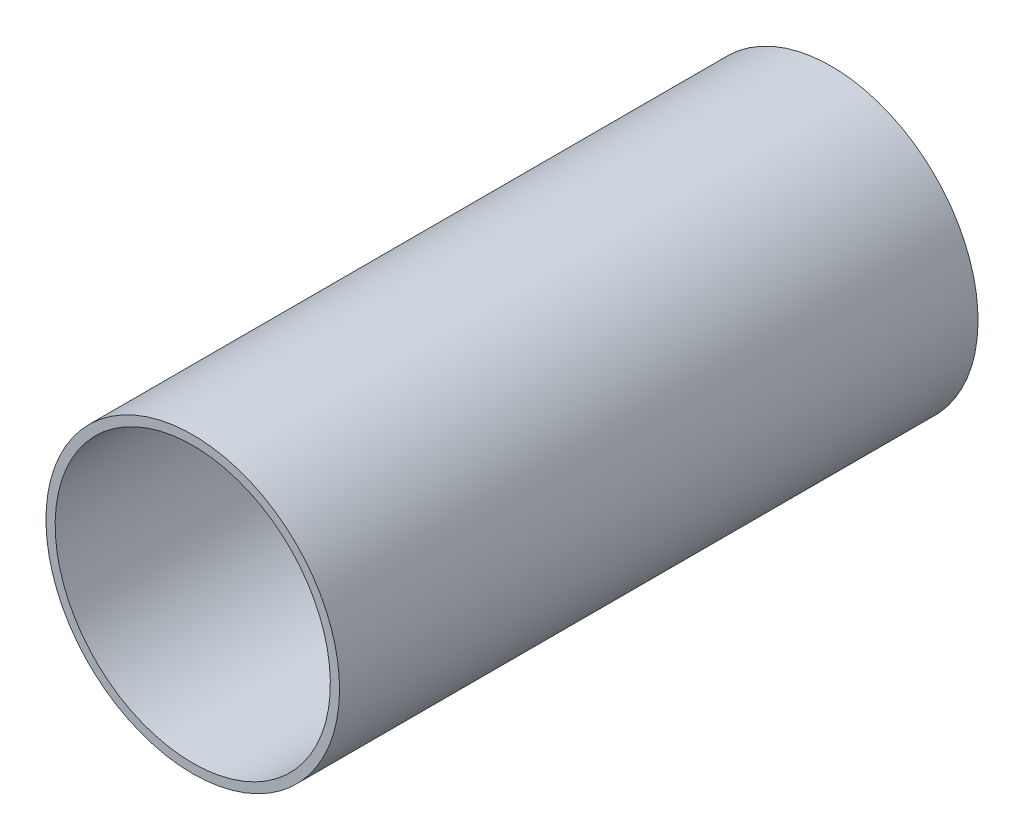
ISO-10303-21;
HEADER;
FILE_DESCRIPTION(('STEP AP214'),'2;1');
FILE_NAME('part.step','',(''),(''),'','','');
FILE_SCHEMA(('AUTOMOTIVE_DESIGN { 1 0 10303 214 1 1 1 1 }'));
ENDSEC;
DATA;
#1=APPLICATION_CONTEXT('core data for automotive mechanical design processes');
#2=APPLICATION_PROTOCOL_DEFINITION('international standard','automotive_design',2000,#1);
#3=PRODUCT_CONTEXT('',#1,'mechanical');
#4=PRODUCT('Part','Part','',(#3));
#5=PRODUCT_RELATED_PRODUCT_CATEGORY('part','',(#4));
#6=PRODUCT_DEFINITION_FORMATION('','',#4);
#7=PRODUCT_DEFINITION_CONTEXT('part definition',#1,'design');
#8=PRODUCT_DEFINITION('design','',#6,#7);
#9=PRODUCT_DEFINITION_SHAPE('','',#8);
#10=(LENGTH_UNIT() NAMED_UNIT(*) SI_UNIT(.MILLI.,.METRE.));
#11=(NAMED_UNIT(*) PLANE_ANGLE_UNIT() SI_UNIT($,.RADIAN.));
#12=(NAMED_UNIT(*) SI_UNIT($,.STERADIAN.) SOLID_ANGLE_UNIT());
#13=UNCERTAINTY_MEASURE_WITH_UNIT(LENGTH_MEASURE(1.E-05),#10,'distance_accuracy_value','');
#14=(GEOMETRIC_REPRESENTATION_CONTEXT(3) GLOBAL_UNCERTAINTY_ASSIGNED_CONTEXT((#13)) GLOBAL_UNIT_ASSIGNED_CONTEXT((#10,
#11,#12)) REPRESENTATION_CONTEXT('',''));
#15=CARTESIAN_POINT('',(0.,0.,0.));
#16=DIRECTION('',(0.,0.,1.));
#17=DIRECTION('',(1.,0.,0.));
#18=AXIS2_PLACEMENT_3D('',#15,#16,#17);
#19=CARTESIAN_POINT('',(162.56,-80.772,-0.045));
#20=DIRECTION('',(0.,0.,-1.));
#21=DIRECTION('',(0.,-1.,0.));
#22=AXIS2_PLACEMENT_3D('',#19,#20,#21);
#23=CYLINDRICAL_SURFACE('',#22,0.375);
#24=CARTESIAN_POINT('',(162.56,-80.772,-0.035));
#25=DIRECTION('',(0.,0.,-1.));
#26=DIRECTION('',(0.,-1.,0.));
#27=AXIS2_PLACEMENT_3D('',#24,#25,#26);
#28=CIRCLE('',#27,0.375);
#29=CARTESIAN_POINT('',(162.56,-81.147,-0.035));
#30=VERTEX_POINT('',#29);
#31=EDGE_CURVE('E65',#30,#30,#28,.T.);
#32=ORIENTED_EDGE('',*,*,#31,.T.);
#33=DIRECTION('',(0.,0.,1.));
#34=VECTOR('',#33,1.);
#35=CARTESIAN_POINT('',(162.56,-81.147,-0.045));
#36=LINE('',#35,#34);
#37=CARTESIAN_POINT('',(162.56,-81.147,1.705));
#38=VERTEX_POINT('',#37);
#39=EDGE_CURVE('E11',#30,#38,#36,.T.);
#40=ORIENTED_EDGE('',*,*,#39,.T.);
#41=CARTESIAN_POINT('',(162.56,-80.772,1.705));
#42=DIRECTION('',(0.,0.,-1.));
#43=DIRECTION('',(0.,-1.,0.));
#44=AXIS2_PLACEMENT_3D('',#41,#42,#43);
#45=CIRCLE('',#44,0.375);
#46=EDGE_CURVE('E20',#38,#38,#45,.T.);
#47=ORIENTED_EDGE('',*,*,#46,.F.);
#48=ORIENTED_EDGE('',*,*,#39,.F.);
#49=EDGE_LOOP('',(#32,#40,#47,#48));
#50=FACE_BOUND('',#49,.T.);
#51=ADVANCED_FACE('F17',(#50),#23,.F.);
#52=CARTESIAN_POINT('',(162.56,-81.172,1.705));
#53=DIRECTION('',(0.,0.,1.));
#54=DIRECTION('',(1.,0.,0.));
#55=AXIS2_PLACEMENT_3D('',#52,#53,#54);
#56=PLANE('',#55);
#57=ORIENTED_EDGE('',*,*,#46,.T.);
#58=EDGE_LOOP('',(#57));
#59=FACE_BOUND('',#58,.T.);
#60=CARTESIAN_POINT('',(162.56,-80.772,1.705));
#61=DIRECTION('',(0.,0.,1.));
#62=DIRECTION('',(0.,-1.,0.));
#63=AXIS2_PLACEMENT_3D('',#60,#61,#62);
#64=CIRCLE('',#63,0.4);
#65=CARTESIAN_POINT('',(162.56,-81.172,1.705));
#66=VERTEX_POINT('',#65);
#67=EDGE_CURVE('E57',#66,#66,#64,.T.);
#68=ORIENTED_EDGE('',*,*,#67,.T.);
#69=EDGE_LOOP('',(#68));
#70=FACE_BOUND('',#69,.T.);
#71=ADVANCED_FACE('F76',(#59,#70),#56,.T.);
#72=CARTESIAN_POINT('',(162.56,-81.172,-0.035));
#73=DIRECTION('',(0.,0.,1.));
#74=DIRECTION('',(1.,0.,0.));
#75=AXIS2_PLACEMENT_3D('',#72,#73,#74);
#76=PLANE('',#75);
#77=ORIENTED_EDGE('',*,*,#31,.F.);
#78=EDGE_LOOP('',(#77));
#79=FACE_BOUND('',#78,.T.);
#80=CARTESIAN_POINT('',(162.56,-80.772,-0.035));
#81=DIRECTION('',(0.,0.,1.));
#82=DIRECTION('',(0.,-1.,0.));
#83=AXIS2_PLACEMENT_3D('',#80,#81,#82);
#84=CIRCLE('',#83,0.4);
#85=CARTESIAN_POINT('',(162.56,-81.172,-0.035));
#86=VERTEX_POINT('',#85);
#87=EDGE_CURVE('E56',#86,#86,#84,.T.);
#88=ORIENTED_EDGE('',*,*,#87,.F.);
#89=EDGE_LOOP('',(#88));
#90=FACE_BOUND('',#89,.T.);
#91=ADVANCED_FACE('F84',(#79,#90),#76,.F.);
#92=CARTESIAN_POINT('',(162.56,-80.772,-0.035));
#93=DIRECTION('',(0.,0.,-1.));
#94=DIRECTION('',(0.,-1.,0.));
#95=AXIS2_PLACEMENT_3D('',#92,#93,#94);
#96=CYLINDRICAL_SURFACE('',#95,0.4);
#97=ORIENTED_EDGE('',*,*,#87,.T.);
#98=DIRECTION('',(0.,0.,1.));
#99=VECTOR('',#98,1.);
#100=CARTESIAN_POINT('',(162.56,-81.172,-0.035));
#101=LINE('',#100,#99);
#102=EDGE_CURVE('E53',#86,#66,#101,.T.);
#103=ORIENTED_EDGE('',*,*,#102,.T.);
#104=ORIENTED_EDGE('',*,*,#67,.F.);
#105=ORIENTED_EDGE('',*,*,#102,.F.);
#106=EDGE_LOOP('',(#97,#103,#104,#105));
#107=FACE_BOUND('',#106,.T.);
#108=ADVANCED_FACE('F54',(#107),#96,.T.);
#109=CLOSED_SHELL('',(#51,#71,#91,#108));
#110=MANIFOLD_SOLID_BREP('B1',#109);
#111=ADVANCED_BREP_SHAPE_REPRESENTATION('',(#18,#110),#14);
#112=SHAPE_DEFINITION_REPRESENTATION(#9,#111);
ENDSEC;
END-ISO-10303-21;
